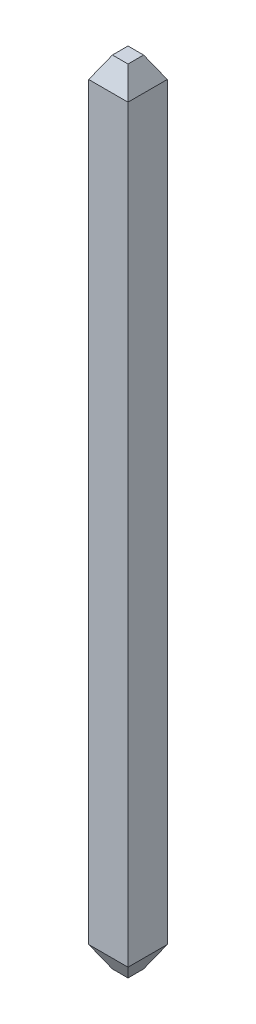
ISO-10303-21;
HEADER;
FILE_DESCRIPTION(('STEP AP214'),'2;1');
FILE_NAME('part.step','',(''),(''),'','','');
FILE_SCHEMA(('AUTOMOTIVE_DESIGN { 1 0 10303 214 1 1 1 1 }'));
ENDSEC;
DATA;
#1=APPLICATION_CONTEXT('core data for automotive mechanical design processes');
#2=APPLICATION_PROTOCOL_DEFINITION('international standard','automotive_design',2000,#1);
#3=PRODUCT_CONTEXT('',#1,'mechanical');
#4=PRODUCT('Part','Part','',(#3));
#5=PRODUCT_RELATED_PRODUCT_CATEGORY('part','',(#4));
#6=PRODUCT_DEFINITION_FORMATION('','',#4);
#7=PRODUCT_DEFINITION_CONTEXT('part definition',#1,'design');
#8=PRODUCT_DEFINITION('design','',#6,#7);
#9=PRODUCT_DEFINITION_SHAPE('','',#8);
#10=(LENGTH_UNIT() NAMED_UNIT(*) SI_UNIT(.MILLI.,.METRE.));
#11=(NAMED_UNIT(*) PLANE_ANGLE_UNIT() SI_UNIT($,.RADIAN.));
#12=(NAMED_UNIT(*) SI_UNIT($,.STERADIAN.) SOLID_ANGLE_UNIT());
#13=UNCERTAINTY_MEASURE_WITH_UNIT(LENGTH_MEASURE(1.E-05),#10,'distance_accuracy_value','');
#14=(GEOMETRIC_REPRESENTATION_CONTEXT(3) GLOBAL_UNCERTAINTY_ASSIGNED_CONTEXT((#13)) GLOBAL_UNIT_ASSIGNED_CONTEXT((#10,
#11,#12)) REPRESENTATION_CONTEXT('',''));
#15=CARTESIAN_POINT('',(0.,0.,0.));
#16=DIRECTION('',(0.,0.,1.));
#17=DIRECTION('',(1.,0.,0.));
#18=AXIS2_PLACEMENT_3D('',#15,#16,#17);
#19=CARTESIAN_POINT('',(0.497289871213,-21.22226807941,2.249039407632));
#20=DIRECTION('',(0.,0.488489958076213,0.87256951634738));
#21=DIRECTION('',(0.,-0.87256951634738,0.488489958076213));
#22=AXIS2_PLACEMENT_3D('',#19,#20,#21);
#23=PLANE('',#22);
#24=DIRECTION('',(1.,0.,0.));
#25=VECTOR('',#24,1.);
#26=CARTESIAN_POINT('',(0.497289871213,-21.57099360271,2.44426616385793));
#27=LINE('',#26,#25);
#28=CARTESIAN_POINT('',(0.48728989589798,-21.5709939289416,2.44426616384538));
#29=VERTEX_POINT('',#28);
#30=CARTESIAN_POINT('',(-0.142710289145667,-21.5709938896675,2.44426632450452));
#31=VERTEX_POINT('',#30);
#32=EDGE_CURVE('E118',#29,#31,#27,.F.);
#33=ORIENTED_EDGE('',*,*,#32,.F.);
#34=DIRECTION('',(0.438284036988266,-0.784297353956641,0.439072617567845));
#35=VECTOR('',#34,1.);
#36=CARTESIAN_POINT('',(0.29728987121219,-21.2309937745705,2.253924307213));
#37=LINE('',#36,#35);
#38=CARTESIAN_POINT('',(0.297289871212797,-21.2309937745703,2.25392430721258));
#39=VERTEX_POINT('',#38);
#40=EDGE_CURVE('E116',#39,#29,#37,.T.);
#41=ORIENTED_EDGE('',*,*,#40,.F.);
#42=DIRECTION('',(-1.,0.,0.));
#43=VECTOR('',#42,1.);
#44=CARTESIAN_POINT('',(0.307289871213,-21.23099377457,2.253924307213));
#45=LINE('',#44,#43);
#46=CARTESIAN_POINT('',(0.0472898712130213,-21.2309937745702,2.25392430721258));
#47=VERTEX_POINT('',#46);
#48=EDGE_CURVE('E79',#47,#39,#45,.F.);
#49=ORIENTED_EDGE('',*,*,#48,.F.);
#50=DIRECTION('',(0.438284036988271,0.78429735395665,-0.439072617567824));
#51=VECTOR('',#50,1.);
#52=CARTESIAN_POINT('',(-0.14271012878781,-21.5709936027095,2.444266163858));
#53=LINE('',#52,#51);
#54=EDGE_CURVE('E110',#31,#47,#53,.T.);
#55=ORIENTED_EDGE('',*,*,#54,.F.);
#56=EDGE_LOOP('',(#33,#41,#49,#55));
#57=FACE_BOUND('',#56,.T.);
#58=ADVANCED_FACE('F17',(#57),#23,.T.);
#59=CARTESIAN_POINT('',(0.497289871213,-33.93541112064,2.249291335356));
#60=DIRECTION('',(0.,-0.487152273933216,0.873317045523387));
#61=DIRECTION('',(0.,-0.873317045523387,-0.487152273933216));
#62=AXIS2_PLACEMENT_3D('',#59,#60,#61);
#63=PLANE('',#62);
#64=DIRECTION('',(-0.438586917260297,-0.784839349958942,-0.437799852403053));
#65=VECTOR('',#64,1.);
#66=CARTESIAN_POINT('',(0.487290184384019,-33.5866775616409,2.443822206765));
#67=LINE('',#66,#65);
#68=CARTESIAN_POINT('',(0.487289980136551,-33.5866774630266,2.44382196176172));
#69=VERTEX_POINT('',#68);
#70=CARTESIAN_POINT('',(0.29728987121302,-33.9266779501895,2.25416285809401));
#71=VERTEX_POINT('',#70);
#72=EDGE_CURVE('E122',#69,#71,#67,.T.);
#73=ORIENTED_EDGE('',*,*,#72,.F.);
#74=DIRECTION('',(1.,0.,0.));
#75=VECTOR('',#74,1.);
#76=CARTESIAN_POINT('',(0.497289871213,-33.5866774970136,2.44382284621967));
#77=LINE('',#76,#75);
#78=CARTESIAN_POINT('',(-0.142710305819021,-33.5866774872793,2.44382196001637));
#79=VERTEX_POINT('',#78);
#80=EDGE_CURVE('E89',#79,#69,#77,.T.);
#81=ORIENTED_EDGE('',*,*,#80,.F.);
#82=DIRECTION('',(-0.438586917260197,0.78483934995876,0.437799852403479));
#83=VECTOR('',#82,1.);
#84=CARTESIAN_POINT('',(0.0472898712136261,-33.9266779501897,2.254162858095));
#85=LINE('',#84,#83);
#86=CARTESIAN_POINT('',(0.0472898712132013,-33.9266779501894,2.25416285809401));
#87=VERTEX_POINT('',#86);
#88=EDGE_CURVE('E84',#87,#79,#85,.T.);
#89=ORIENTED_EDGE('',*,*,#88,.F.);
#90=DIRECTION('',(1.,0.,0.));
#91=VECTOR('',#90,1.);
#92=CARTESIAN_POINT('',(0.03728987121306,-33.92667795019,2.254162858095));
#93=LINE('',#92,#91);
#94=EDGE_CURVE('E20',#71,#87,#93,.F.);
#95=ORIENTED_EDGE('',*,*,#94,.F.);
#96=EDGE_LOOP('',(#73,#81,#89,#95));
#97=FACE_BOUND('',#96,.T.);
#98=ADVANCED_FACE('F86',(#97),#63,.T.);
#99=CARTESIAN_POINT('',(0.03728987121306,-33.92667795019,1.994162858095));
#100=DIRECTION('',(0.,-1.,0.));
#101=DIRECTION('',(1.,0.,0.));
#102=AXIS2_PLACEMENT_3D('',#99,#100,#101);
#103=PLANE('',#102);
#104=DIRECTION('',(0.,0.,1.));
#105=VECTOR('',#104,1.);
#106=CARTESIAN_POINT('',(0.0472898712136262,-33.9266779501897,1.803821001451));
#107=LINE('',#106,#105);
#108=CARTESIAN_POINT('',(0.0472898712133431,-33.9266779501896,2.00416285809542));
#109=VERTEX_POINT('',#108);
#110=EDGE_CURVE('E93',#109,#87,#107,.T.);
#111=ORIENTED_EDGE('',*,*,#110,.F.);
#112=DIRECTION('',(1.,0.,0.));
#113=VECTOR('',#112,1.);
#114=CARTESIAN_POINT('',(0.497289871213,-33.9266779501891,2.00416285809666));
#115=LINE('',#114,#113);
#116=CARTESIAN_POINT('',(0.29728987121304,-33.9266779501898,2.00416285809542));
#117=VERTEX_POINT('',#116);
#118=EDGE_CURVE('E129',#117,#109,#115,.F.);
#119=ORIENTED_EDGE('',*,*,#118,.F.);
#120=DIRECTION('',(0.,0.,1.));
#121=VECTOR('',#120,1.);
#122=CARTESIAN_POINT('',(0.297289871213079,-33.92667795019,1.803821001451));
#123=LINE('',#122,#121);
#124=EDGE_CURVE('E98',#71,#117,#123,.F.);
#125=ORIENTED_EDGE('',*,*,#124,.F.);
#126=ORIENTED_EDGE('',*,*,#94,.T.);
#127=EDGE_LOOP('',(#111,#119,#125,#126));
#128=FACE_BOUND('',#127,.T.);
#129=ADVANCED_FACE('F95',(#128),#103,.T.);
#130=CARTESIAN_POINT('',(0.05216808666874,-33.93540738396,1.803821001451));
#131=DIRECTION('',(-0.872943377132686,-0.487821545567825,0.));
#132=DIRECTION('',(0.487821545567825,-0.872943377132686,0.));
#133=AXIS2_PLACEMENT_3D('',#130,#131,#132);
#134=PLANE('',#133);
#135=DIRECTION('',(-0.43828470044216,0.784297071672233,-0.439072459537929));
#136=VECTOR('',#135,1.);
#137=CARTESIAN_POINT('',(0.04728987121306,-33.9266779501891,2.00416285809666));
#138=LINE('',#137,#136);
#139=CARTESIAN_POINT('',(-0.142710211258918,-33.5866782459584,1.81382181091626));
#140=VERTEX_POINT('',#139);
#141=EDGE_CURVE('E102',#109,#140,#138,.T.);
#142=ORIENTED_EDGE('',*,*,#141,.F.);
#143=ORIENTED_EDGE('',*,*,#110,.T.);
#144=ORIENTED_EDGE('',*,*,#88,.T.);
#145=DIRECTION('',(0.,0.,1.));
#146=VECTOR('',#145,1.);
#147=CARTESIAN_POINT('',(-0.142710128787,-33.58667874778,2.128990896586));
#148=LINE('',#147,#146);
#149=EDGE_CURVE('E131',#140,#79,#148,.T.);
#150=ORIENTED_EDGE('',*,*,#149,.F.);
#151=EDGE_LOOP('',(#142,#143,#144,#150));
#152=FACE_BOUND('',#151,.T.);
#153=ADVANCED_FACE('F100',(#152),#134,.T.);
#154=CARTESIAN_POINT('',(0.307289871213,-21.23099377457,1.993924307213));
#155=DIRECTION('',(0.,1.,0.));
#156=DIRECTION('',(-1.,0.,0.));
#157=AXIS2_PLACEMENT_3D('',#154,#155,#156);
#158=PLANE('',#157);
#159=ORIENTED_EDGE('',*,*,#48,.T.);
#160=DIRECTION('',(0.,0.,1.));
#161=VECTOR('',#160,1.);
#162=CARTESIAN_POINT('',(0.29728987121219,-21.2309937745705,1.804266163858));
#163=LINE('',#162,#161);
#164=CARTESIAN_POINT('',(0.297289871212797,-21.2309937745704,2.00392430721349));
#165=VERTEX_POINT('',#164);
#166=EDGE_CURVE('E113',#165,#39,#163,.T.);
#167=ORIENTED_EDGE('',*,*,#166,.F.);
#168=DIRECTION('',(1.,0.,0.));
#169=VECTOR('',#168,1.);
#170=CARTESIAN_POINT('',(0.497289871213,-21.2309937745711,2.00392430721498));
#171=LINE('',#170,#169);
#172=CARTESIAN_POINT('',(0.0472898712130212,-21.2309937745703,2.00392430721349));
#173=VERTEX_POINT('',#172);
#174=EDGE_CURVE('E140',#173,#165,#171,.T.);
#175=ORIENTED_EDGE('',*,*,#174,.F.);
#176=DIRECTION('',(0.,0.,1.));
#177=VECTOR('',#176,1.);
#178=CARTESIAN_POINT('',(0.047289871212935,-21.2309937745699,1.804266163858));
#179=LINE('',#178,#177);
#180=EDGE_CURVE('E105',#47,#173,#179,.F.);
#181=ORIENTED_EDGE('',*,*,#180,.F.);
#182=EDGE_LOOP('',(#159,#167,#175,#181));
#183=FACE_BOUND('',#182,.T.);
#184=ADVANCED_FACE('F184',(#183),#158,.T.);
#185=CARTESIAN_POINT('',(-0.147588344243,-21.57972303648,1.804266163858));
#186=DIRECTION('',(-0.872943377132686,0.487821545567825,0.));
#187=DIRECTION('',(-0.487821545567825,-0.872943377132686,0.));
#188=AXIS2_PLACEMENT_3D('',#185,#186,#187);
#189=PLANE('',#188);
#190=DIRECTION('',(0.,0.,1.));
#191=VECTOR('',#190,1.);
#192=CARTESIAN_POINT('',(-0.142710128787008,-21.57099360271,2.128990896586));
#193=LINE('',#192,#191);
#194=CARTESIAN_POINT('',(-0.142710835596165,-21.5709953440113,1.81426575489926));
#195=VERTEX_POINT('',#194);
#196=EDGE_CURVE('E137',#31,#195,#193,.F.);
#197=ORIENTED_EDGE('',*,*,#196,.F.);
#198=ORIENTED_EDGE('',*,*,#54,.T.);
#199=ORIENTED_EDGE('',*,*,#180,.T.);
#200=DIRECTION('',(0.43858642909022,0.784840434712895,0.437798396819316));
#201=VECTOR('',#200,1.);
#202=CARTESIAN_POINT('',(-0.142710849418,-21.5709957406264,1.81426497129039));
#203=LINE('',#202,#201);
#204=EDGE_CURVE('E145',#195,#173,#203,.T.);
#205=ORIENTED_EDGE('',*,*,#204,.F.);
#206=EDGE_LOOP('',(#197,#198,#199,#205));
#207=FACE_BOUND('',#206,.T.);
#208=ADVANCED_FACE('F182',(#207),#189,.T.);
#209=CARTESIAN_POINT('',(0.292411655757,-21.2222643408,1.804266163858));
#210=DIRECTION('',(0.872943377132686,0.487821545567825,0.));
#211=DIRECTION('',(-0.487821545567825,0.872943377132686,0.));
#212=AXIS2_PLACEMENT_3D('',#209,#210,#211);
#213=PLANE('',#212);
#214=ORIENTED_EDGE('',*,*,#166,.T.);
#215=ORIENTED_EDGE('',*,*,#40,.T.);
#216=DIRECTION('',(0.,0.,1.));
#217=VECTOR('',#216,1.);
#218=CARTESIAN_POINT('',(0.487289871212996,-21.57099621256,1.803872654069));
#219=LINE('',#218,#217);
#220=CARTESIAN_POINT('',(0.487290141449586,-21.5709947896532,1.81426628939786));
#221=VERTEX_POINT('',#220);
#222=EDGE_CURVE('E35',#221,#29,#219,.T.);
#223=ORIENTED_EDGE('',*,*,#222,.F.);
#224=DIRECTION('',(0.438586429090131,-0.784840434712933,-0.437798396819338));
#225=VECTOR('',#224,1.);
#226=CARTESIAN_POINT('',(0.297289871213,-21.2309937745711,2.00392430721498));
#227=LINE('',#226,#225);
#228=EDGE_CURVE('E143',#165,#221,#227,.T.);
#229=ORIENTED_EDGE('',*,*,#228,.F.);
#230=EDGE_LOOP('',(#214,#215,#223,#229));
#231=FACE_BOUND('',#230,.T.);
#232=ADVANCED_FACE('F185',(#231),#213,.T.);
#233=CARTESIAN_POINT('',(0.497289871213,-21.45033675752,2.444270615482));
#234=DIRECTION('',(0.,-3.68949151673641E-05,0.999999999319383));
#235=DIRECTION('',(0.,-0.999999999319383,-3.68949151673641E-05));
#236=AXIS2_PLACEMENT_3D('',#233,#234,#235);
#237=PLANE('',#236);
#238=DIRECTION('',(0.,0.999999999317418,3.69481335064379E-05));
#239=VECTOR('',#238,1.);
#240=CARTESIAN_POINT('',(-0.142710128787,-33.58667749699,2.443822206765));
#241=LINE('',#240,#239);
#242=EDGE_CURVE('E134',#79,#31,#241,.T.);
#243=ORIENTED_EDGE('',*,*,#242,.F.);
#244=ORIENTED_EDGE('',*,*,#80,.T.);
#245=DIRECTION('',(0.,-0.999999999317418,-3.69481335064379E-05));
#246=VECTOR('',#245,1.);
#247=CARTESIAN_POINT('',(0.487289871212996,-21.57099360271,2.444266163858));
#248=LINE('',#247,#246);
#249=EDGE_CURVE('E149',#29,#69,#248,.T.);
#250=ORIENTED_EDGE('',*,*,#249,.F.);
#251=ORIENTED_EDGE('',*,*,#32,.T.);
#252=EDGE_LOOP('',(#243,#244,#250,#251));
#253=FACE_BOUND('',#252,.T.);
#254=ADVANCED_FACE('F187',(#253),#237,.T.);
#255=CARTESIAN_POINT('',(0.492168086669,-33.57794868828,1.803821001451));
#256=DIRECTION('',(0.872943377132686,-0.487821545567825,0.));
#257=DIRECTION('',(0.487821545567825,0.872943377132686,0.));
#258=AXIS2_PLACEMENT_3D('',#255,#256,#257);
#259=PLANE('',#258);
#260=ORIENTED_EDGE('',*,*,#124,.T.);
#261=DIRECTION('',(-0.438284700442048,-0.78429707167228,0.439072459537956));
#262=VECTOR('',#261,1.);
#263=CARTESIAN_POINT('',(0.487289673578,-33.5866791127601,1.81382155607999));
#264=LINE('',#263,#262);
#265=CARTESIAN_POINT('',(0.487289755137329,-33.5866786503075,1.81382212481551));
#266=VERTEX_POINT('',#265);
#267=EDGE_CURVE('E126',#266,#117,#264,.T.);
#268=ORIENTED_EDGE('',*,*,#267,.F.);
#269=DIRECTION('',(0.,0.,1.));
#270=VECTOR('',#269,1.);
#271=CARTESIAN_POINT('',(0.487289871213004,-33.58667749699,1.803872654069));
#272=LINE('',#271,#270);
#273=EDGE_CURVE('E152',#69,#266,#272,.F.);
#274=ORIENTED_EDGE('',*,*,#273,.F.);
#275=ORIENTED_EDGE('',*,*,#72,.T.);
#276=EDGE_LOOP('',(#260,#268,#274,#275));
#277=FACE_BOUND('',#276,.T.);
#278=ADVANCED_FACE('F174',(#277),#259,.T.);
#279=CARTESIAN_POINT('',(0.497289871213,-33.93540364535,2.009047757676));
#280=DIRECTION('',(0.,-0.488489958076213,-0.87256951634738));
#281=DIRECTION('',(0.,0.87256951634738,-0.488489958076213));
#282=AXIS2_PLACEMENT_3D('',#279,#280,#281);
#283=PLANE('',#282);
#284=ORIENTED_EDGE('',*,*,#267,.T.);
#285=ORIENTED_EDGE('',*,*,#118,.T.);
#286=ORIENTED_EDGE('',*,*,#141,.T.);
#287=DIRECTION('',(1.,0.,0.));
#288=VECTOR('',#287,1.);
#289=CARTESIAN_POINT('',(0.497289871213,-33.5866787478035,1.81382284617289));
#290=LINE('',#289,#288);
#291=EDGE_CURVE('E155',#266,#140,#290,.F.);
#292=ORIENTED_EDGE('',*,*,#291,.F.);
#293=EDGE_LOOP('',(#284,#285,#286,#292));
#294=FACE_BOUND('',#293,.T.);
#295=ADVANCED_FACE('F177',(#294),#283,.T.);
#296=CARTESIAN_POINT('',(-0.142710128787,-33.75733847732,2.128990896586));
#297=DIRECTION('',(-1.,0.,0.));
#298=DIRECTION('',(0.,-1.,0.));
#299=AXIS2_PLACEMENT_3D('',#296,#297,#298);
#300=PLANE('',#299);
#301=ORIENTED_EDGE('',*,*,#196,.T.);
#302=DIRECTION('',(0.,0.999999999319383,3.68949151676141E-05));
#303=VECTOR('',#302,1.);
#304=CARTESIAN_POINT('',(-0.142709931152,-33.75734199129,1.813816549567));
#305=LINE('',#304,#303);
#306=EDGE_CURVE('E158',#140,#195,#305,.T.);
#307=ORIENTED_EDGE('',*,*,#306,.F.);
#308=ORIENTED_EDGE('',*,*,#149,.T.);
#309=ORIENTED_EDGE('',*,*,#242,.T.);
#310=EDGE_LOOP('',(#301,#307,#308,#309));
#311=FACE_BOUND('',#310,.T.);
#312=ADVANCED_FACE('F179',(#311),#300,.T.);
#313=CARTESIAN_POINT('',(0.497289871213,-21.22226060412,2.008795829952));
#314=DIRECTION('',(0.,0.487152273933216,-0.873317045523387));
#315=DIRECTION('',(0.,0.873317045523387,0.487152273933216));
#316=AXIS2_PLACEMENT_3D('',#313,#314,#315);
#317=PLANE('',#316);
#318=DIRECTION('',(1.,0.,0.));
#319=VECTOR('',#318,1.);
#320=CARTESIAN_POINT('',(0.497289871213,-21.5709962125728,1.81426616376101));
#321=LINE('',#320,#319);
#322=EDGE_CURVE('E26',#195,#221,#321,.T.);
#323=ORIENTED_EDGE('',*,*,#322,.F.);
#324=ORIENTED_EDGE('',*,*,#204,.T.);
#325=ORIENTED_EDGE('',*,*,#174,.T.);
#326=ORIENTED_EDGE('',*,*,#228,.T.);
#327=EDGE_LOOP('',(#323,#324,#325,#326));
#328=FACE_BOUND('',#327,.T.);
#329=ADVANCED_FACE('F168',(#328),#317,.T.);
#330=CARTESIAN_POINT('',(0.487289871213,-27.60384299983,1.803872654069));
#331=DIRECTION('',(1.,0.,0.));
#332=DIRECTION('',(0.,1.,0.));
#333=AXIS2_PLACEMENT_3D('',#330,#331,#332);
#334=PLANE('',#333);
#335=ORIENTED_EDGE('',*,*,#249,.T.);
#336=ORIENTED_EDGE('',*,*,#273,.T.);
#337=DIRECTION('',(0.,0.999999999319383,3.68949151676141E-05));
#338=VECTOR('',#337,1.);
#339=CARTESIAN_POINT('',(0.487290591844,-33.75734199129,1.813816549567));
#340=LINE('',#339,#338);
#341=EDGE_CURVE('E11',#221,#266,#340,.F.);
#342=ORIENTED_EDGE('',*,*,#341,.F.);
#343=ORIENTED_EDGE('',*,*,#222,.T.);
#344=EDGE_LOOP('',(#335,#336,#342,#343));
#345=FACE_BOUND('',#344,.T.);
#346=ADVANCED_FACE('F170',(#345),#334,.T.);
#347=CARTESIAN_POINT('',(0.497289871213,-33.75734199129,1.813816549567));
#348=DIRECTION('',(0.,3.68949151676141E-05,-0.999999999319383));
#349=DIRECTION('',(0.,0.999999999319383,3.68949151676141E-05));
#350=AXIS2_PLACEMENT_3D('',#347,#348,#349);
#351=PLANE('',#350);
#352=ORIENTED_EDGE('',*,*,#322,.T.);
#353=ORIENTED_EDGE('',*,*,#341,.T.);
#354=ORIENTED_EDGE('',*,*,#291,.T.);
#355=ORIENTED_EDGE('',*,*,#306,.T.);
#356=EDGE_LOOP('',(#352,#353,#354,#355));
#357=FACE_BOUND('',#356,.T.);
#358=ADVANCED_FACE('F164',(#357),#351,.T.);
#359=CLOSED_SHELL('',(#58,#98,#129,#153,#184,#208,#232,#254,#278,#295,#312,#329,#346,#358));
#360=MANIFOLD_SOLID_BREP('B1',#359);
#361=ADVANCED_BREP_SHAPE_REPRESENTATION('',(#18,#360),#14);
#362=SHAPE_DEFINITION_REPRESENTATION(#9,#361);
ENDSEC;
END-ISO-10303-21;
